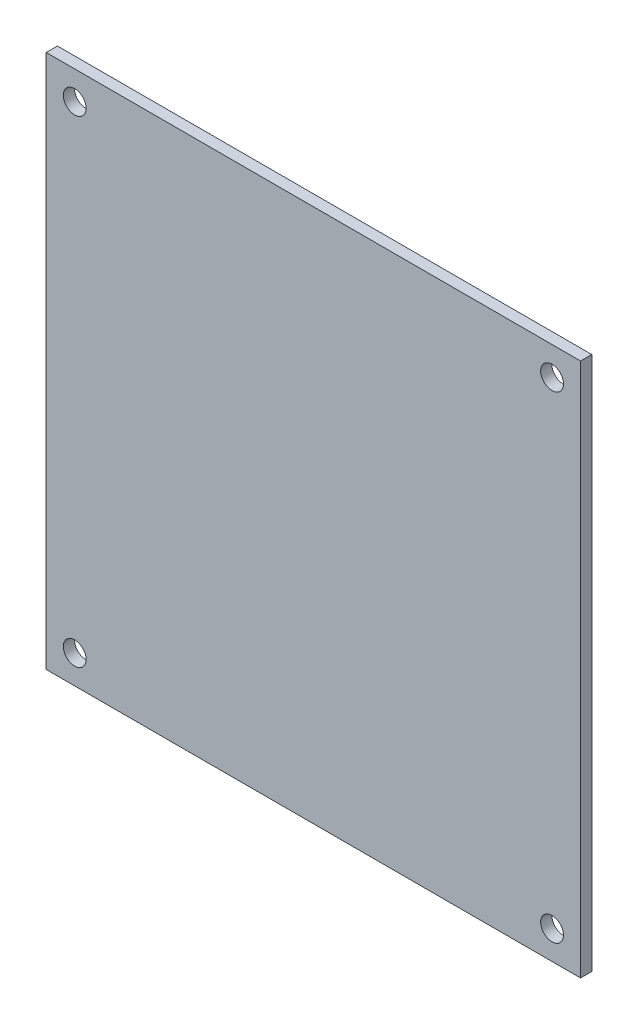
ISO-10303-21;
HEADER;
FILE_DESCRIPTION(('STEP AP214'),'2;1');
FILE_NAME('part.step','',(''),(''),'','','');
FILE_SCHEMA(('AUTOMOTIVE_DESIGN { 1 0 10303 214 1 1 1 1 }'));
ENDSEC;
DATA;
#1=APPLICATION_CONTEXT('core data for automotive mechanical design processes');
#2=APPLICATION_PROTOCOL_DEFINITION('international standard','automotive_design',2000,#1);
#3=PRODUCT_CONTEXT('',#1,'mechanical');
#4=PRODUCT('Part','Part','',(#3));
#5=PRODUCT_RELATED_PRODUCT_CATEGORY('part','',(#4));
#6=PRODUCT_DEFINITION_FORMATION('','',#4);
#7=PRODUCT_DEFINITION_CONTEXT('part definition',#1,'design');
#8=PRODUCT_DEFINITION('design','',#6,#7);
#9=PRODUCT_DEFINITION_SHAPE('','',#8);
#10=(LENGTH_UNIT() NAMED_UNIT(*) SI_UNIT(.MILLI.,.METRE.));
#11=(NAMED_UNIT(*) PLANE_ANGLE_UNIT() SI_UNIT($,.RADIAN.));
#12=(NAMED_UNIT(*) SI_UNIT($,.STERADIAN.) SOLID_ANGLE_UNIT());
#13=UNCERTAINTY_MEASURE_WITH_UNIT(LENGTH_MEASURE(1.E-05),#10,'distance_accuracy_value','');
#14=(GEOMETRIC_REPRESENTATION_CONTEXT(3) GLOBAL_UNCERTAINTY_ASSIGNED_CONTEXT((#13)) GLOBAL_UNIT_ASSIGNED_CONTEXT((#10,
#11,#12)) REPRESENTATION_CONTEXT('',''));
#15=CARTESIAN_POINT('',(0.,0.,0.));
#16=DIRECTION('',(0.,0.,1.));
#17=DIRECTION('',(1.,0.,0.));
#18=AXIS2_PLACEMENT_3D('',#15,#16,#17);
#19=CARTESIAN_POINT('',(0.,0.,1.5748));
#20=DIRECTION('',(0.,0.,1.));
#21=DIRECTION('',(1.,0.,0.));
#22=AXIS2_PLACEMENT_3D('',#19,#20,#21);
#23=PLANE('',#22);
#24=CARTESIAN_POINT('',(-59.2951214713258,-33.5420761224554,1.5748));
#25=DIRECTION('',(0.,0.,1.));
#26=DIRECTION('',(1.,0.,0.));
#27=AXIS2_PLACEMENT_3D('',#24,#25,#26);
#28=CIRCLE('',#27,1.59999999999999);
#29=CARTESIAN_POINT('',(-57.6951214713258,-33.5420761224554,1.5748));
#30=VERTEX_POINT('',#29);
#31=EDGE_CURVE('E121',#30,#30,#28,.T.);
#32=ORIENTED_EDGE('',*,*,#31,.F.);
#33=EDGE_LOOP('',(#32));
#34=FACE_BOUND('',#33,.T.);
#35=CARTESIAN_POINT('',(-59.2951214713258,33.4579238775445,1.5748));
#36=DIRECTION('',(0.,0.,1.));
#37=DIRECTION('',(1.,0.,0.));
#38=AXIS2_PLACEMENT_3D('',#35,#36,#37);
#39=CIRCLE('',#38,1.59999999999999);
#40=CARTESIAN_POINT('',(-57.6951214713258,33.4579238775445,1.5748));
#41=VERTEX_POINT('',#40);
#42=EDGE_CURVE('E100',#41,#41,#39,.T.);
#43=ORIENTED_EDGE('',*,*,#42,.F.);
#44=EDGE_LOOP('',(#43));
#45=FACE_BOUND('',#44,.T.);
#46=DIRECTION('',(0.,-1.,0.));
#47=VECTOR('',#46,1.);
#48=CARTESIAN_POINT('',(-63.2951211497258,37.4579239533446,1.5748));
#49=LINE('',#48,#47);
#50=CARTESIAN_POINT('',(-63.2951211497258,37.4579239533446,1.5748));
#51=VERTEX_POINT('',#50);
#52=CARTESIAN_POINT('',(-63.2951211497258,-37.5420753016554,1.5748));
#53=VERTEX_POINT('',#52);
#54=EDGE_CURVE('E85',#51,#53,#49,.T.);
#55=ORIENTED_EDGE('',*,*,#54,.T.);
#56=DIRECTION('',(1.,0.,0.));
#57=VECTOR('',#56,1.);
#58=CARTESIAN_POINT('',(-63.2951211497258,-37.5420753016554,1.5748));
#59=LINE('',#58,#57);
#60=CARTESIAN_POINT('',(11.7048781052742,-37.5420753016554,1.5748));
#61=VERTEX_POINT('',#60);
#62=EDGE_CURVE('E80',#53,#61,#59,.T.);
#63=ORIENTED_EDGE('',*,*,#62,.T.);
#64=DIRECTION('',(0.,1.,0.));
#65=VECTOR('',#64,1.);
#66=CARTESIAN_POINT('',(11.7048781052742,37.4579239533446,1.5748));
#67=LINE('',#66,#65);
#68=CARTESIAN_POINT('',(11.7048781052742,37.4579239533446,1.5748));
#69=VERTEX_POINT('',#68);
#70=EDGE_CURVE('E83',#61,#69,#67,.T.);
#71=ORIENTED_EDGE('',*,*,#70,.T.);
#72=DIRECTION('',(-1.,0.,0.));
#73=VECTOR('',#72,1.);
#74=CARTESIAN_POINT('',(-63.2951211497258,37.4579239533446,1.5748));
#75=LINE('',#74,#73);
#76=EDGE_CURVE('E50',#69,#51,#75,.T.);
#77=ORIENTED_EDGE('',*,*,#76,.T.);
#78=EDGE_LOOP('',(#55,#63,#71,#77));
#79=FACE_BOUND('',#78,.T.);
#80=CARTESIAN_POINT('',(7.70487852867424,33.4579238775445,1.5748));
#81=DIRECTION('',(0.,0.,1.));
#82=DIRECTION('',(1.,0.,0.));
#83=AXIS2_PLACEMENT_3D('',#80,#81,#82);
#84=CIRCLE('',#83,1.59999999999999);
#85=CARTESIAN_POINT('',(9.30487852867423,33.4579238775445,1.5748));
#86=VERTEX_POINT('',#85);
#87=EDGE_CURVE('E115',#86,#86,#84,.T.);
#88=ORIENTED_EDGE('',*,*,#87,.F.);
#89=EDGE_LOOP('',(#88));
#90=FACE_BOUND('',#89,.T.);
#91=CARTESIAN_POINT('',(7.70487852867424,-33.5420761224554,1.5748));
#92=DIRECTION('',(0.,0.,1.));
#93=DIRECTION('',(1.,0.,0.));
#94=AXIS2_PLACEMENT_3D('',#91,#92,#93);
#95=CIRCLE('',#94,1.59999999999999);
#96=CARTESIAN_POINT('',(9.30487852867423,-33.5420761224554,1.5748));
#97=VERTEX_POINT('',#96);
#98=EDGE_CURVE('E127',#97,#97,#95,.T.);
#99=ORIENTED_EDGE('',*,*,#98,.F.);
#100=EDGE_LOOP('',(#99));
#101=FACE_BOUND('',#100,.T.);
#102=ADVANCED_FACE('F33',(#34,#45,#79,#90,#101),#23,.T.);
#103=CARTESIAN_POINT('',(0.,0.,0.));
#104=DIRECTION('',(0.,0.,1.));
#105=DIRECTION('',(1.,0.,0.));
#106=AXIS2_PLACEMENT_3D('',#103,#104,#105);
#107=PLANE('',#106);
#108=CARTESIAN_POINT('',(-59.2951214713258,-33.5420761224554,0.));
#109=DIRECTION('',(0.,0.,1.));
#110=DIRECTION('',(1.,0.,0.));
#111=AXIS2_PLACEMENT_3D('',#108,#109,#110);
#112=CIRCLE('',#111,1.59999999999999);
#113=CARTESIAN_POINT('',(-57.6951214713258,-33.5420761224554,0.));
#114=VERTEX_POINT('',#113);
#115=EDGE_CURVE('E124',#114,#114,#112,.T.);
#116=ORIENTED_EDGE('',*,*,#115,.T.);
#117=EDGE_LOOP('',(#116));
#118=FACE_BOUND('',#117,.T.);
#119=CARTESIAN_POINT('',(-59.2951214713258,33.4579238775445,0.));
#120=DIRECTION('',(0.,0.,1.));
#121=DIRECTION('',(1.,0.,0.));
#122=AXIS2_PLACEMENT_3D('',#119,#120,#121);
#123=CIRCLE('',#122,1.59999999999999);
#124=CARTESIAN_POINT('',(-57.6951214713258,33.4579238775445,0.));
#125=VERTEX_POINT('',#124);
#126=EDGE_CURVE('E112',#125,#125,#123,.T.);
#127=ORIENTED_EDGE('',*,*,#126,.T.);
#128=EDGE_LOOP('',(#127));
#129=FACE_BOUND('',#128,.T.);
#130=DIRECTION('',(0.,-1.,0.));
#131=VECTOR('',#130,1.);
#132=CARTESIAN_POINT('',(-63.2951211497258,37.4579239533446,0.));
#133=LINE('',#132,#131);
#134=CARTESIAN_POINT('',(-63.2951211497258,37.4579239533446,0.));
#135=VERTEX_POINT('',#134);
#136=CARTESIAN_POINT('',(-63.2951211497258,-37.5420753016554,0.));
#137=VERTEX_POINT('',#136);
#138=EDGE_CURVE('E97',#135,#137,#133,.T.);
#139=ORIENTED_EDGE('',*,*,#138,.F.);
#140=DIRECTION('',(-1.,0.,0.));
#141=VECTOR('',#140,1.);
#142=CARTESIAN_POINT('',(-63.2951211497258,37.4579239533446,0.));
#143=LINE('',#142,#141);
#144=CARTESIAN_POINT('',(11.7048781052742,37.4579239533446,0.));
#145=VERTEX_POINT('',#144);
#146=EDGE_CURVE('E73',#145,#135,#143,.T.);
#147=ORIENTED_EDGE('',*,*,#146,.F.);
#148=DIRECTION('',(0.,1.,0.));
#149=VECTOR('',#148,1.);
#150=CARTESIAN_POINT('',(11.7048781052742,37.4579239533446,0.));
#151=LINE('',#150,#149);
#152=CARTESIAN_POINT('',(11.7048781052742,-37.5420753016554,0.));
#153=VERTEX_POINT('',#152);
#154=EDGE_CURVE('E67',#153,#145,#151,.T.);
#155=ORIENTED_EDGE('',*,*,#154,.F.);
#156=DIRECTION('',(1.,0.,0.));
#157=VECTOR('',#156,1.);
#158=CARTESIAN_POINT('',(-63.2951211497258,-37.5420753016554,0.));
#159=LINE('',#158,#157);
#160=EDGE_CURVE('E89',#137,#153,#159,.T.);
#161=ORIENTED_EDGE('',*,*,#160,.F.);
#162=EDGE_LOOP('',(#139,#147,#155,#161));
#163=FACE_BOUND('',#162,.T.);
#164=CARTESIAN_POINT('',(7.70487852867424,33.4579238775445,0.));
#165=DIRECTION('',(0.,0.,1.));
#166=DIRECTION('',(1.,0.,0.));
#167=AXIS2_PLACEMENT_3D('',#164,#165,#166);
#168=CIRCLE('',#167,1.59999999999999);
#169=CARTESIAN_POINT('',(9.30487852867423,33.4579238775445,0.));
#170=VERTEX_POINT('',#169);
#171=EDGE_CURVE('E118',#170,#170,#168,.T.);
#172=ORIENTED_EDGE('',*,*,#171,.T.);
#173=EDGE_LOOP('',(#172));
#174=FACE_BOUND('',#173,.T.);
#175=CARTESIAN_POINT('',(7.70487852867424,-33.5420761224554,0.));
#176=DIRECTION('',(0.,0.,1.));
#177=DIRECTION('',(1.,0.,0.));
#178=AXIS2_PLACEMENT_3D('',#175,#176,#177);
#179=CIRCLE('',#178,1.59999999999999);
#180=CARTESIAN_POINT('',(9.30487852867423,-33.5420761224554,0.));
#181=VERTEX_POINT('',#180);
#182=EDGE_CURVE('E130',#181,#181,#179,.T.);
#183=ORIENTED_EDGE('',*,*,#182,.T.);
#184=EDGE_LOOP('',(#183));
#185=FACE_BOUND('',#184,.T.);
#186=ADVANCED_FACE('F108',(#118,#129,#163,#174,#185),#107,.F.);
#187=CARTESIAN_POINT('',(-63.2951211497258,37.4579239533446,1.5748));
#188=DIRECTION('',(1.,0.,0.));
#189=DIRECTION('',(0.,0.,-1.));
#190=AXIS2_PLACEMENT_3D('',#187,#188,#189);
#191=PLANE('',#190);
#192=ORIENTED_EDGE('',*,*,#138,.T.);
#193=DIRECTION('',(0.,0.,-1.));
#194=VECTOR('',#193,1.);
#195=CARTESIAN_POINT('',(-63.2951211497258,-37.5420753016554,1.5748));
#196=LINE('',#195,#194);
#197=EDGE_CURVE('E11',#53,#137,#196,.T.);
#198=ORIENTED_EDGE('',*,*,#197,.F.);
#199=ORIENTED_EDGE('',*,*,#54,.F.);
#200=DIRECTION('',(0.,0.,-1.));
#201=VECTOR('',#200,1.);
#202=CARTESIAN_POINT('',(-63.2951211497258,37.4579239533446,1.5748));
#203=LINE('',#202,#201);
#204=EDGE_CURVE('E93',#51,#135,#203,.T.);
#205=ORIENTED_EDGE('',*,*,#204,.T.);
#206=EDGE_LOOP('',(#192,#198,#199,#205));
#207=FACE_BOUND('',#206,.T.);
#208=ADVANCED_FACE('F35',(#207),#191,.F.);
#209=CARTESIAN_POINT('',(-63.2951211497258,-37.5420753016554,1.5748));
#210=DIRECTION('',(0.,1.,0.));
#211=DIRECTION('',(0.,0.,1.));
#212=AXIS2_PLACEMENT_3D('',#209,#210,#211);
#213=PLANE('',#212);
#214=ORIENTED_EDGE('',*,*,#160,.T.);
#215=DIRECTION('',(0.,0.,-1.));
#216=VECTOR('',#215,1.);
#217=CARTESIAN_POINT('',(11.7048781052742,-37.5420753016554,1.5748));
#218=LINE('',#217,#216);
#219=EDGE_CURVE('E42',#61,#153,#218,.T.);
#220=ORIENTED_EDGE('',*,*,#219,.F.);
#221=ORIENTED_EDGE('',*,*,#62,.F.);
#222=ORIENTED_EDGE('',*,*,#197,.T.);
#223=EDGE_LOOP('',(#214,#220,#221,#222));
#224=FACE_BOUND('',#223,.T.);
#225=ADVANCED_FACE('F88',(#224),#213,.F.);
#226=CARTESIAN_POINT('',(11.7048781052742,37.4579239533446,1.5748));
#227=DIRECTION('',(-1.,0.,0.));
#228=DIRECTION('',(0.,0.,1.));
#229=AXIS2_PLACEMENT_3D('',#226,#227,#228);
#230=PLANE('',#229);
#231=ORIENTED_EDGE('',*,*,#154,.T.);
#232=DIRECTION('',(0.,0.,-1.));
#233=VECTOR('',#232,1.);
#234=CARTESIAN_POINT('',(11.7048781052742,37.4579239533446,1.5748));
#235=LINE('',#234,#233);
#236=EDGE_CURVE('E90',#69,#145,#235,.T.);
#237=ORIENTED_EDGE('',*,*,#236,.F.);
#238=ORIENTED_EDGE('',*,*,#70,.F.);
#239=ORIENTED_EDGE('',*,*,#219,.T.);
#240=EDGE_LOOP('',(#231,#237,#238,#239));
#241=FACE_BOUND('',#240,.T.);
#242=ADVANCED_FACE('F91',(#241),#230,.F.);
#243=CARTESIAN_POINT('',(-63.2951211497258,37.4579239533446,1.5748));
#244=DIRECTION('',(0.,-1.,0.));
#245=DIRECTION('',(0.,0.,-1.));
#246=AXIS2_PLACEMENT_3D('',#243,#244,#245);
#247=PLANE('',#246);
#248=ORIENTED_EDGE('',*,*,#146,.T.);
#249=ORIENTED_EDGE('',*,*,#204,.F.);
#250=ORIENTED_EDGE('',*,*,#76,.F.);
#251=ORIENTED_EDGE('',*,*,#236,.T.);
#252=EDGE_LOOP('',(#248,#249,#250,#251));
#253=FACE_BOUND('',#252,.T.);
#254=ADVANCED_FACE('F105',(#253),#247,.F.);
#255=CARTESIAN_POINT('',(-59.2951214713258,33.4579238775445,1.5748));
#256=DIRECTION('',(0.,0.,-1.));
#257=DIRECTION('',(-1.,0.,0.));
#258=AXIS2_PLACEMENT_3D('',#255,#256,#257);
#259=CYLINDRICAL_SURFACE('',#258,1.59999999999999);
#260=ORIENTED_EDGE('',*,*,#42,.T.);
#261=EDGE_LOOP('',(#260));
#262=FACE_BOUND('',#261,.T.);
#263=ORIENTED_EDGE('',*,*,#126,.F.);
#264=EDGE_LOOP('',(#263));
#265=FACE_BOUND('',#264,.T.);
#266=ADVANCED_FACE('F150',(#262,#265),#259,.F.);
#267=CARTESIAN_POINT('',(7.70487852867424,33.4579238775445,1.5748));
#268=DIRECTION('',(0.,0.,-1.));
#269=DIRECTION('',(-1.,0.,0.));
#270=AXIS2_PLACEMENT_3D('',#267,#268,#269);
#271=CYLINDRICAL_SURFACE('',#270,1.59999999999999);
#272=ORIENTED_EDGE('',*,*,#87,.T.);
#273=EDGE_LOOP('',(#272));
#274=FACE_BOUND('',#273,.T.);
#275=ORIENTED_EDGE('',*,*,#171,.F.);
#276=EDGE_LOOP('',(#275));
#277=FACE_BOUND('',#276,.T.);
#278=ADVANCED_FACE('F196',(#274,#277),#271,.F.);
#279=CARTESIAN_POINT('',(-59.2951214713258,-33.5420761224554,1.5748));
#280=DIRECTION('',(0.,0.,-1.));
#281=DIRECTION('',(-1.,0.,0.));
#282=AXIS2_PLACEMENT_3D('',#279,#280,#281);
#283=CYLINDRICAL_SURFACE('',#282,1.59999999999999);
#284=ORIENTED_EDGE('',*,*,#31,.T.);
#285=EDGE_LOOP('',(#284));
#286=FACE_BOUND('',#285,.T.);
#287=ORIENTED_EDGE('',*,*,#115,.F.);
#288=EDGE_LOOP('',(#287));
#289=FACE_BOUND('',#288,.T.);
#290=ADVANCED_FACE('F204',(#286,#289),#283,.F.);
#291=CARTESIAN_POINT('',(7.70487852867424,-33.5420761224554,1.5748));
#292=DIRECTION('',(0.,0.,-1.));
#293=DIRECTION('',(-1.,0.,0.));
#294=AXIS2_PLACEMENT_3D('',#291,#292,#293);
#295=CYLINDRICAL_SURFACE('',#294,1.59999999999999);
#296=ORIENTED_EDGE('',*,*,#98,.T.);
#297=EDGE_LOOP('',(#296));
#298=FACE_BOUND('',#297,.T.);
#299=ORIENTED_EDGE('',*,*,#182,.F.);
#300=EDGE_LOOP('',(#299));
#301=FACE_BOUND('',#300,.T.);
#302=ADVANCED_FACE('F136',(#298,#301),#295,.F.);
#303=CLOSED_SHELL('',(#102,#186,#208,#225,#242,#254,#266,#278,#290,#302));
#304=MANIFOLD_SOLID_BREP('B2',#303);
#305=ADVANCED_BREP_SHAPE_REPRESENTATION('',(#18,#304),#14);
#306=SHAPE_DEFINITION_REPRESENTATION(#9,#305);
ENDSEC;
END-ISO-10303-21;
